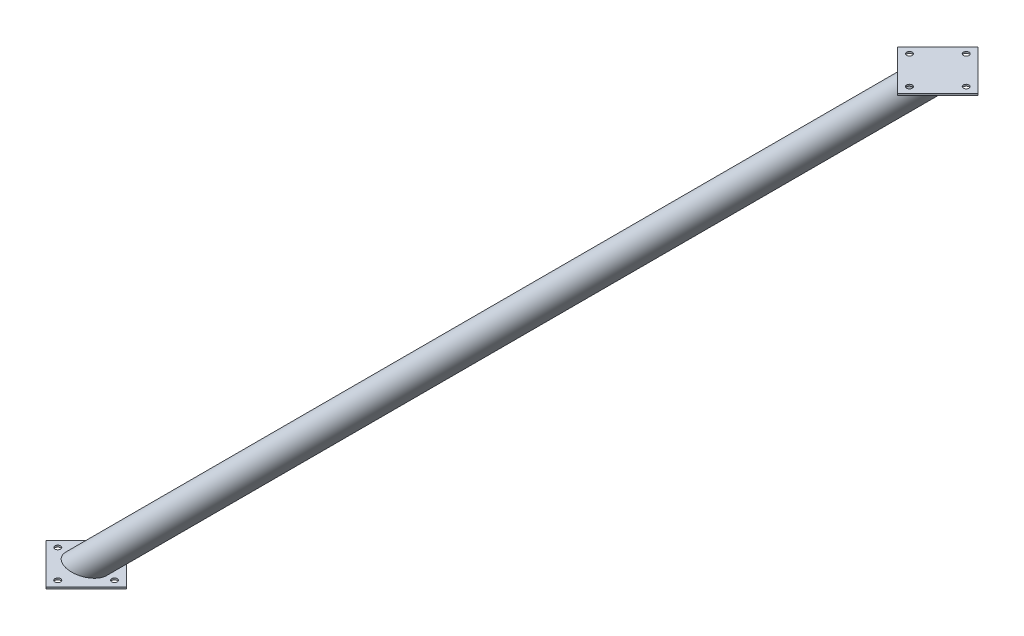
ISO-10303-21;
HEADER;
FILE_DESCRIPTION(('STEP AP214'),'2;1');
FILE_NAME('part.step','',(''),(''),'','','');
FILE_SCHEMA(('AUTOMOTIVE_DESIGN { 1 0 10303 214 1 1 1 1 }'));
ENDSEC;
DATA;
#1=APPLICATION_CONTEXT('core data for automotive mechanical design processes');
#2=APPLICATION_PROTOCOL_DEFINITION('international standard','automotive_design',2000,#1);
#3=PRODUCT_CONTEXT('',#1,'mechanical');
#4=PRODUCT('Part','Part','',(#3));
#5=PRODUCT_RELATED_PRODUCT_CATEGORY('part','',(#4));
#6=PRODUCT_DEFINITION_FORMATION('','',#4);
#7=PRODUCT_DEFINITION_CONTEXT('part definition',#1,'design');
#8=PRODUCT_DEFINITION('design','',#6,#7);
#9=PRODUCT_DEFINITION_SHAPE('','',#8);
#10=(LENGTH_UNIT() NAMED_UNIT(*) SI_UNIT(.MILLI.,.METRE.));
#11=(NAMED_UNIT(*) PLANE_ANGLE_UNIT() SI_UNIT($,.RADIAN.));
#12=(NAMED_UNIT(*) SI_UNIT($,.STERADIAN.) SOLID_ANGLE_UNIT());
#13=UNCERTAINTY_MEASURE_WITH_UNIT(LENGTH_MEASURE(1.E-05),#10,'distance_accuracy_value','');
#14=(GEOMETRIC_REPRESENTATION_CONTEXT(3) GLOBAL_UNCERTAINTY_ASSIGNED_CONTEXT((#13)) GLOBAL_UNIT_ASSIGNED_CONTEXT((#10,
#11,#12)) REPRESENTATION_CONTEXT('',''));
#15=CARTESIAN_POINT('',(0.,0.,0.));
#16=DIRECTION('',(0.,0.,1.));
#17=DIRECTION('',(1.,0.,0.));
#18=AXIS2_PLACEMENT_3D('',#15,#16,#17);
#19=CARTESIAN_POINT('',(1500.,1500.,0.));
#20=DIRECTION('',(0.707106781186548,0.707106781186548,0.));
#21=DIRECTION('',(-0.707106781186548,0.707106781186548,0.));
#22=AXIS2_PLACEMENT_3D('',#19,#20,#21);
#23=CYLINDRICAL_SURFACE('',#22,25.399999999994);
#24=CARTESIAN_POINT('',(1500.00000000001,1500.00000000001,0.));
#25=DIRECTION('',(0.,1.,0.));
#26=DIRECTION('',(1.,0.,0.));
#27=AXIS2_PLACEMENT_3D('',#24,#25,#26);
#28=ELLIPSE('',#27,35.9210244842682,25.399999999994);
#29=CARTESIAN_POINT('',(1535.92102448427,1500.00000000001,0.));
#30=VERTEX_POINT('',#29);
#31=EDGE_CURVE('E59',#30,#30,#28,.T.);
#32=ORIENTED_EDGE('',*,*,#31,.F.);
#33=EDGE_LOOP('',(#32));
#34=FACE_BOUND('',#33,.T.);
#35=CARTESIAN_POINT('',(-3.10862446895044E-11,-3.10862446895044E-11,0.));
#36=DIRECTION('',(0.,-1.,0.));
#37=DIRECTION('',(1.,0.,0.));
#38=AXIS2_PLACEMENT_3D('',#35,#36,#37);
#39=ELLIPSE('',#38,35.9210244842682,25.399999999994);
#40=CARTESIAN_POINT('',(35.9210244842371,-3.10863531097216E-11,0.));
#41=VERTEX_POINT('',#40);
#42=EDGE_CURVE('E11',#41,#41,#39,.T.);
#43=ORIENTED_EDGE('',*,*,#42,.F.);
#44=EDGE_LOOP('',(#43));
#45=FACE_BOUND('',#44,.T.);
#46=ADVANCED_FACE('F48',(#34,#45),#23,.T.);
#47=CARTESIAN_POINT('',(0.,0.,0.));
#48=DIRECTION('',(0.,1.,0.));
#49=DIRECTION('',(-1.,0.,0.));
#50=AXIS2_PLACEMENT_3D('',#47,#48,#49);
#51=PLANE('',#50);
#52=CARTESIAN_POINT('',(-5.23722200826471E-13,0.,-50.));
#53=DIRECTION('',(0.,-1.,0.));
#54=DIRECTION('',(1.,0.,0.));
#55=AXIS2_PLACEMENT_3D('',#52,#53,#54);
#56=CIRCLE('',#55,5.);
#57=CARTESIAN_POINT('',(4.99999999999947,-3.24526984570526E-13,-50.));
#58=VERTEX_POINT('',#57);
#59=EDGE_CURVE('E138',#58,#58,#56,.T.);
#60=ORIENTED_EDGE('',*,*,#59,.T.);
#61=EDGE_LOOP('',(#60));
#62=FACE_BOUND('',#61,.T.);
#63=CARTESIAN_POINT('',(1.74574066942157E-13,0.,50.));
#64=DIRECTION('',(0.,-1.,0.));
#65=DIRECTION('',(1.,0.,0.));
#66=AXIS2_PLACEMENT_3D('',#63,#64,#65);
#67=CIRCLE('',#66,5.);
#68=CARTESIAN_POINT('',(5.00000000000017,-3.24526984570571E-13,50.));
#69=VERTEX_POINT('',#68);
#70=EDGE_CURVE('E212',#69,#69,#67,.T.);
#71=ORIENTED_EDGE('',*,*,#70,.T.);
#72=EDGE_LOOP('',(#71));
#73=FACE_BOUND('',#72,.T.);
#74=DIRECTION('',(-0.707106781186551,0.,0.707106781186544));
#75=VECTOR('',#74,1.);
#76=CARTESIAN_POINT('',(-6.48044415375831E-13,0.,70.7106781186544));
#77=LINE('',#76,#75);
#78=CARTESIAN_POINT('',(70.7106781186543,-4.58950462935727E-12,1.66533453693773E-13));
#79=VERTEX_POINT('',#78);
#80=CARTESIAN_POINT('',(-6.48044415375831E-13,0.,70.7106781186544));
#81=VERTEX_POINT('',#80);
#82=EDGE_CURVE('E228',#79,#81,#77,.T.);
#83=ORIENTED_EDGE('',*,*,#82,.F.);
#84=DIRECTION('',(0.707106781186544,0.,0.707106781186551));
#85=VECTOR('',#84,1.);
#86=CARTESIAN_POINT('',(70.7106781186543,-4.58950462935727E-12,1.66533453693773E-13));
#87=LINE('',#86,#85);
#88=CARTESIAN_POINT('',(-3.88578058618804E-13,0.,-70.7106781186551));
#89=VERTEX_POINT('',#88);
#90=EDGE_CURVE('E91',#89,#79,#87,.T.);
#91=ORIENTED_EDGE('',*,*,#90,.F.);
#92=DIRECTION('',(0.707106781186548,0.,-0.707106781186547));
#93=VECTOR('',#92,1.);
#94=CARTESIAN_POINT('',(-3.88578058618804E-13,0.,-70.7106781186551));
#95=LINE('',#94,#93);
#96=CARTESIAN_POINT('',(-70.7106781186552,4.58950462935733E-12,-4.71844785465692E-13));
#97=VERTEX_POINT('',#96);
#98=EDGE_CURVE('E85',#97,#89,#95,.T.);
#99=ORIENTED_EDGE('',*,*,#98,.F.);
#100=DIRECTION('',(-0.707106781186546,0.,-0.707106781186549));
#101=VECTOR('',#100,1.);
#102=CARTESIAN_POINT('',(-70.7106781186552,4.58950462935733E-12,-4.71844785465692E-13));
#103=LINE('',#102,#101);
#104=EDGE_CURVE('E246',#81,#97,#103,.T.);
#105=ORIENTED_EDGE('',*,*,#104,.F.);
#106=EDGE_LOOP('',(#83,#91,#99,#105));
#107=FACE_BOUND('',#106,.T.);
#108=CARTESIAN_POINT('',(-50.,3.2452698457056E-12,0.));
#109=DIRECTION('',(0.,-1.,0.));
#110=DIRECTION('',(1.,0.,0.));
#111=AXIS2_PLACEMENT_3D('',#108,#109,#110);
#112=CIRCLE('',#111,5.);
#113=CARTESIAN_POINT('',(-45.0000000000001,2.92074286113504E-12,0.));
#114=VERTEX_POINT('',#113);
#115=EDGE_CURVE('E220',#114,#114,#112,.T.);
#116=ORIENTED_EDGE('',*,*,#115,.T.);
#117=EDGE_LOOP('',(#116));
#118=FACE_BOUND('',#117,.T.);
#119=CARTESIAN_POINT('',(50.,-3.2452698457056E-12,-3.49148133884314E-13));
#120=DIRECTION('',(0.,-1.,0.));
#121=DIRECTION('',(1.,0.,0.));
#122=AXIS2_PLACEMENT_3D('',#119,#120,#121);
#123=CIRCLE('',#122,4.99999999999999);
#124=CARTESIAN_POINT('',(55.,-3.56979683027616E-12,-3.49148133884314E-13));
#125=VERTEX_POINT('',#124);
#126=EDGE_CURVE('E204',#125,#125,#123,.T.);
#127=ORIENTED_EDGE('',*,*,#126,.T.);
#128=EDGE_LOOP('',(#127));
#129=FACE_BOUND('',#128,.T.);
#130=ORIENTED_EDGE('',*,*,#42,.T.);
#131=EDGE_LOOP('',(#130));
#132=FACE_BOUND('',#131,.T.);
#133=ADVANCED_FACE('F279',(#62,#73,#107,#118,#129,#132),#51,.T.);
#134=CARTESIAN_POINT('',(-1.94716190742336E-13,-3.,0.));
#135=DIRECTION('',(0.,1.,0.));
#136=DIRECTION('',(-1.,0.,0.));
#137=AXIS2_PLACEMENT_3D('',#134,#135,#136);
#138=PLANE('',#137);
#139=DIRECTION('',(-0.707106781186551,0.,0.707106781186544));
#140=VECTOR('',#139,1.);
#141=CARTESIAN_POINT('',(-8.42760606118167E-13,-3.,70.7106781186544));
#142=LINE('',#141,#140);
#143=CARTESIAN_POINT('',(70.7106781186541,-3.00000000000459,1.66533453693773E-13));
#144=VERTEX_POINT('',#143);
#145=CARTESIAN_POINT('',(-8.42760606118167E-13,-3.,70.7106781186544));
#146=VERTEX_POINT('',#145);
#147=EDGE_CURVE('E232',#144,#146,#142,.T.);
#148=ORIENTED_EDGE('',*,*,#147,.T.);
#149=DIRECTION('',(-0.707106781186546,0.,-0.707106781186549));
#150=VECTOR('',#149,1.);
#151=CARTESIAN_POINT('',(-70.7106781186554,-2.99999999999541,-4.71844785465692E-13));
#152=LINE('',#151,#150);
#153=CARTESIAN_POINT('',(-70.7106781186554,-2.99999999999541,-4.71844785465692E-13));
#154=VERTEX_POINT('',#153);
#155=EDGE_CURVE('E99',#146,#154,#152,.T.);
#156=ORIENTED_EDGE('',*,*,#155,.T.);
#157=DIRECTION('',(0.707106781186548,0.,-0.707106781186547));
#158=VECTOR('',#157,1.);
#159=CARTESIAN_POINT('',(-5.8329424936114E-13,-3.,-70.7106781186551));
#160=LINE('',#159,#158);
#161=CARTESIAN_POINT('',(-5.8329424936114E-13,-3.,-70.7106781186551));
#162=VERTEX_POINT('',#161);
#163=EDGE_CURVE('E237',#154,#162,#160,.T.);
#164=ORIENTED_EDGE('',*,*,#163,.T.);
#165=DIRECTION('',(0.707106781186544,0.,0.707106781186551));
#166=VECTOR('',#165,1.);
#167=CARTESIAN_POINT('',(70.7106781186541,-3.00000000000459,1.66533453693773E-13));
#168=LINE('',#167,#166);
#169=EDGE_CURVE('E67',#162,#144,#168,.T.);
#170=ORIENTED_EDGE('',*,*,#169,.T.);
#171=EDGE_LOOP('',(#148,#156,#164,#170));
#172=FACE_BOUND('',#171,.T.);
#173=CARTESIAN_POINT('',(-50.0000000000002,-2.99999999999676,0.));
#174=DIRECTION('',(0.,-1.,0.));
#175=DIRECTION('',(1.,0.,0.));
#176=AXIS2_PLACEMENT_3D('',#173,#174,#175);
#177=CIRCLE('',#176,5.);
#178=CARTESIAN_POINT('',(-45.0000000000002,-2.99999999999708,0.));
#179=VERTEX_POINT('',#178);
#180=EDGE_CURVE('E224',#179,#179,#177,.T.);
#181=ORIENTED_EDGE('',*,*,#180,.F.);
#182=EDGE_LOOP('',(#181));
#183=FACE_BOUND('',#182,.T.);
#184=CARTESIAN_POINT('',(0.,-3.,50.));
#185=DIRECTION('',(0.,-1.,0.));
#186=DIRECTION('',(1.,0.,0.));
#187=AXIS2_PLACEMENT_3D('',#184,#185,#186);
#188=CIRCLE('',#187,5.);
#189=CARTESIAN_POINT('',(4.99999999999998,-3.00000000000032,50.));
#190=VERTEX_POINT('',#189);
#191=EDGE_CURVE('E216',#190,#190,#188,.T.);
#192=ORIENTED_EDGE('',*,*,#191,.F.);
#193=EDGE_LOOP('',(#192));
#194=FACE_BOUND('',#193,.T.);
#195=CARTESIAN_POINT('',(49.9999999999999,-3.00000000000325,-3.49148133884314E-13));
#196=DIRECTION('',(0.,-1.,0.));
#197=DIRECTION('',(1.,0.,0.));
#198=AXIS2_PLACEMENT_3D('',#195,#196,#197);
#199=CIRCLE('',#198,4.99999999999999);
#200=CARTESIAN_POINT('',(54.9999999999999,-3.00000000000357,-3.49148133884314E-13));
#201=VERTEX_POINT('',#200);
#202=EDGE_CURVE('E208',#201,#201,#199,.T.);
#203=ORIENTED_EDGE('',*,*,#202,.F.);
#204=EDGE_LOOP('',(#203));
#205=FACE_BOUND('',#204,.T.);
#206=CARTESIAN_POINT('',(-7.18438391568806E-13,-3.,-50.));
#207=DIRECTION('',(0.,-1.,0.));
#208=DIRECTION('',(1.,0.,0.));
#209=AXIS2_PLACEMENT_3D('',#206,#207,#208);
#210=CIRCLE('',#209,5.);
#211=CARTESIAN_POINT('',(4.99999999999928,-3.00000000000032,-50.));
#212=VERTEX_POINT('',#211);
#213=EDGE_CURVE('E200',#212,#212,#210,.T.);
#214=ORIENTED_EDGE('',*,*,#213,.F.);
#215=EDGE_LOOP('',(#214));
#216=FACE_BOUND('',#215,.T.);
#217=ADVANCED_FACE('F283',(#172,#183,#194,#205,#216),#138,.F.);
#218=CARTESIAN_POINT('',(-8.42760606118167E-13,-3.,70.7106781186544));
#219=DIRECTION('',(-0.707106781186544,0.,-0.707106781186551));
#220=DIRECTION('',(-0.707106781186551,0.,0.707106781186544));
#221=AXIS2_PLACEMENT_3D('',#218,#219,#220);
#222=PLANE('',#221);
#223=ORIENTED_EDGE('',*,*,#82,.T.);
#224=DIRECTION('',(0.,1.,0.));
#225=VECTOR('',#224,1.);
#226=CARTESIAN_POINT('',(-8.42760606118167E-13,-3.,70.7106781186544));
#227=LINE('',#226,#225);
#228=EDGE_CURVE('E261',#146,#81,#227,.T.);
#229=ORIENTED_EDGE('',*,*,#228,.F.);
#230=ORIENTED_EDGE('',*,*,#147,.F.);
#231=DIRECTION('',(0.,1.,0.));
#232=VECTOR('',#231,1.);
#233=CARTESIAN_POINT('',(70.7106781186541,-3.00000000000459,1.66533453693773E-13));
#234=LINE('',#233,#232);
#235=EDGE_CURVE('E242',#144,#79,#234,.T.);
#236=ORIENTED_EDGE('',*,*,#235,.T.);
#237=EDGE_LOOP('',(#223,#229,#230,#236));
#238=FACE_BOUND('',#237,.T.);
#239=ADVANCED_FACE('F291',(#238),#222,.F.);
#240=CARTESIAN_POINT('',(-70.7106781186554,-2.99999999999541,-4.71844785465692E-13));
#241=DIRECTION('',(0.707106781186549,0.,-0.707106781186546));
#242=DIRECTION('',(-0.707106781186546,0.,-0.707106781186549));
#243=AXIS2_PLACEMENT_3D('',#240,#241,#242);
#244=PLANE('',#243);
#245=ORIENTED_EDGE('',*,*,#104,.T.);
#246=DIRECTION('',(0.,1.,0.));
#247=VECTOR('',#246,1.);
#248=CARTESIAN_POINT('',(-70.7106781186554,-2.99999999999541,-4.71844785465692E-13));
#249=LINE('',#248,#247);
#250=EDGE_CURVE('E258',#154,#97,#249,.T.);
#251=ORIENTED_EDGE('',*,*,#250,.F.);
#252=ORIENTED_EDGE('',*,*,#155,.F.);
#253=ORIENTED_EDGE('',*,*,#228,.T.);
#254=EDGE_LOOP('',(#245,#251,#252,#253));
#255=FACE_BOUND('',#254,.T.);
#256=ADVANCED_FACE('F389',(#255),#244,.F.);
#257=CARTESIAN_POINT('',(-5.8329424936114E-13,-3.,-70.7106781186551));
#258=DIRECTION('',(0.707106781186547,0.,0.707106781186548));
#259=DIRECTION('',(0.707106781186548,0.,-0.707106781186547));
#260=AXIS2_PLACEMENT_3D('',#257,#258,#259);
#261=PLANE('',#260);
#262=ORIENTED_EDGE('',*,*,#98,.T.);
#263=DIRECTION('',(0.,1.,0.));
#264=VECTOR('',#263,1.);
#265=CARTESIAN_POINT('',(-5.8329424936114E-13,-3.,-70.7106781186551));
#266=LINE('',#265,#264);
#267=EDGE_CURVE('E255',#162,#89,#266,.T.);
#268=ORIENTED_EDGE('',*,*,#267,.F.);
#269=ORIENTED_EDGE('',*,*,#163,.F.);
#270=ORIENTED_EDGE('',*,*,#250,.T.);
#271=EDGE_LOOP('',(#262,#268,#269,#270));
#272=FACE_BOUND('',#271,.T.);
#273=ADVANCED_FACE('F364',(#272),#261,.F.);
#274=CARTESIAN_POINT('',(70.7106781186541,-3.00000000000459,1.66533453693773E-13));
#275=DIRECTION('',(-0.707106781186551,0.,0.707106781186544));
#276=DIRECTION('',(0.707106781186544,0.,0.707106781186551));
#277=AXIS2_PLACEMENT_3D('',#274,#275,#276);
#278=PLANE('',#277);
#279=ORIENTED_EDGE('',*,*,#90,.T.);
#280=ORIENTED_EDGE('',*,*,#235,.F.);
#281=ORIENTED_EDGE('',*,*,#169,.F.);
#282=ORIENTED_EDGE('',*,*,#267,.T.);
#283=EDGE_LOOP('',(#279,#280,#281,#282));
#284=FACE_BOUND('',#283,.T.);
#285=ADVANCED_FACE('F359',(#284),#278,.F.);
#286=CARTESIAN_POINT('',(-50.0000000000002,-2.99999999999676,0.));
#287=DIRECTION('',(0.,1.,0.));
#288=DIRECTION('',(-1.,0.,0.));
#289=AXIS2_PLACEMENT_3D('',#286,#287,#288);
#290=CYLINDRICAL_SURFACE('',#289,5.);
#291=ORIENTED_EDGE('',*,*,#180,.T.);
#292=EDGE_LOOP('',(#291));
#293=FACE_BOUND('',#292,.T.);
#294=ORIENTED_EDGE('',*,*,#115,.F.);
#295=EDGE_LOOP('',(#294));
#296=FACE_BOUND('',#295,.T.);
#297=ADVANCED_FACE('F356',(#293,#296),#290,.F.);
#298=CARTESIAN_POINT('',(0.,-3.,50.));
#299=DIRECTION('',(0.,1.,0.));
#300=DIRECTION('',(-1.,0.,0.));
#301=AXIS2_PLACEMENT_3D('',#298,#299,#300);
#302=CYLINDRICAL_SURFACE('',#301,5.);
#303=ORIENTED_EDGE('',*,*,#191,.T.);
#304=EDGE_LOOP('',(#303));
#305=FACE_BOUND('',#304,.T.);
#306=ORIENTED_EDGE('',*,*,#70,.F.);
#307=EDGE_LOOP('',(#306));
#308=FACE_BOUND('',#307,.T.);
#309=ADVANCED_FACE('F352',(#305,#308),#302,.F.);
#310=CARTESIAN_POINT('',(49.9999999999999,-3.00000000000325,-3.49148133884314E-13));
#311=DIRECTION('',(0.,1.,0.));
#312=DIRECTION('',(-1.,0.,0.));
#313=AXIS2_PLACEMENT_3D('',#310,#311,#312);
#314=CYLINDRICAL_SURFACE('',#313,4.99999999999999);
#315=ORIENTED_EDGE('',*,*,#202,.T.);
#316=EDGE_LOOP('',(#315));
#317=FACE_BOUND('',#316,.T.);
#318=ORIENTED_EDGE('',*,*,#126,.F.);
#319=EDGE_LOOP('',(#318));
#320=FACE_BOUND('',#319,.T.);
#321=ADVANCED_FACE('F320',(#317,#320),#314,.F.);
#322=CARTESIAN_POINT('',(-7.18438391568806E-13,-3.,-50.));
#323=DIRECTION('',(0.,1.,0.));
#324=DIRECTION('',(-1.,0.,0.));
#325=AXIS2_PLACEMENT_3D('',#322,#323,#324);
#326=CYLINDRICAL_SURFACE('',#325,5.);
#327=ORIENTED_EDGE('',*,*,#213,.T.);
#328=EDGE_LOOP('',(#327));
#329=FACE_BOUND('',#328,.T.);
#330=ORIENTED_EDGE('',*,*,#59,.F.);
#331=EDGE_LOOP('',(#330));
#332=FACE_BOUND('',#331,.T.);
#333=ADVANCED_FACE('F313',(#329,#332),#326,.F.);
#334=CARTESIAN_POINT('',(0.,1500.00000000001,0.));
#335=DIRECTION('',(0.,1.,0.));
#336=DIRECTION('',(0.,0.,1.));
#337=AXIS2_PLACEMENT_3D('',#334,#335,#336);
#338=PLANE('',#337);
#339=DIRECTION('',(0.707106781186548,0.,0.707106781186547));
#340=VECTOR('',#339,1.);
#341=CARTESIAN_POINT('',(785.355339059329,1500.00000000001,-785.35533905933));
#342=LINE('',#341,#340);
#343=CARTESIAN_POINT('',(1500.,1500.00000000001,-70.7106781186543));
#344=VERTEX_POINT('',#343);
#345=CARTESIAN_POINT('',(1570.71067811866,1500.00000000001,3.33066907387547E-13));
#346=VERTEX_POINT('',#345);
#347=EDGE_CURVE('E132',#344,#346,#342,.T.);
#348=ORIENTED_EDGE('',*,*,#347,.T.);
#349=DIRECTION('',(-0.707106781186548,0.,0.707106781186547));
#350=VECTOR('',#349,1.);
#351=CARTESIAN_POINT('',(785.355339059328,1500.00000000001,785.35533905933));
#352=LINE('',#351,#350);
#353=CARTESIAN_POINT('',(1500.,1500.00000000001,70.7106781186546));
#354=VERTEX_POINT('',#353);
#355=EDGE_CURVE('E188',#346,#354,#352,.T.);
#356=ORIENTED_EDGE('',*,*,#355,.T.);
#357=DIRECTION('',(-0.707106781186547,0.,-0.707106781186548));
#358=VECTOR('',#357,1.);
#359=CARTESIAN_POINT('',(714.644660940677,1500.00000000001,-714.644660940675));
#360=LINE('',#359,#358);
#361=CARTESIAN_POINT('',(1429.28932188135,1500.00000000001,2.22044604925031E-13));
#362=VERTEX_POINT('',#361);
#363=EDGE_CURVE('E184',#354,#362,#360,.T.);
#364=ORIENTED_EDGE('',*,*,#363,.T.);
#365=DIRECTION('',(0.707106781186547,0.,-0.707106781186548));
#366=VECTOR('',#365,1.);
#367=CARTESIAN_POINT('',(714.644660940676,1500.00000000001,714.644660940675));
#368=LINE('',#367,#366);
#369=EDGE_CURVE('E181',#362,#344,#368,.T.);
#370=ORIENTED_EDGE('',*,*,#369,.T.);
#371=EDGE_LOOP('',(#348,#356,#364,#370));
#372=FACE_BOUND('',#371,.T.);
#373=CARTESIAN_POINT('',(1500.,1500.00000000001,-49.9999999999999));
#374=DIRECTION('',(0.,1.,0.));
#375=DIRECTION('',(0.,0.,1.));
#376=AXIS2_PLACEMENT_3D('',#373,#374,#375);
#377=CIRCLE('',#376,5.00000000000005);
#378=CARTESIAN_POINT('',(1500.,1500.00000000001,-44.9999999999999));
#379=VERTEX_POINT('',#378);
#380=EDGE_CURVE('E175',#379,#379,#377,.T.);
#381=ORIENTED_EDGE('',*,*,#380,.T.);
#382=EDGE_LOOP('',(#381));
#383=FACE_BOUND('',#382,.T.);
#384=CARTESIAN_POINT('',(1550.,1500.00000000001,-2.22044604925031E-13));
#385=DIRECTION('',(0.,1.,0.));
#386=DIRECTION('',(0.,0.,1.));
#387=AXIS2_PLACEMENT_3D('',#384,#385,#386);
#388=CIRCLE('',#387,5.00000000000005);
#389=CARTESIAN_POINT('',(1550.,1500.00000000001,4.99999999999983));
#390=VERTEX_POINT('',#389);
#391=EDGE_CURVE('E171',#390,#390,#388,.T.);
#392=ORIENTED_EDGE('',*,*,#391,.T.);
#393=EDGE_LOOP('',(#392));
#394=FACE_BOUND('',#393,.T.);
#395=CARTESIAN_POINT('',(1500.,1500.00000000001,49.9999999999996));
#396=DIRECTION('',(0.,1.,0.));
#397=DIRECTION('',(0.,0.,1.));
#398=AXIS2_PLACEMENT_3D('',#395,#396,#397);
#399=CIRCLE('',#398,5.00000000000005);
#400=CARTESIAN_POINT('',(1500.,1500.00000000001,54.9999999999997));
#401=VERTEX_POINT('',#400);
#402=EDGE_CURVE('E167',#401,#401,#399,.T.);
#403=ORIENTED_EDGE('',*,*,#402,.T.);
#404=EDGE_LOOP('',(#403));
#405=FACE_BOUND('',#404,.T.);
#406=CARTESIAN_POINT('',(1450.00000000001,1500.00000000001,0.));
#407=DIRECTION('',(0.,1.,0.));
#408=DIRECTION('',(0.,0.,1.));
#409=AXIS2_PLACEMENT_3D('',#406,#407,#408);
#410=CIRCLE('',#409,4.99999999999982);
#411=CARTESIAN_POINT('',(1450.00000000001,1500.00000000001,4.99999999999982));
#412=VERTEX_POINT('',#411);
#413=EDGE_CURVE('E163',#412,#412,#410,.T.);
#414=ORIENTED_EDGE('',*,*,#413,.T.);
#415=EDGE_LOOP('',(#414));
#416=FACE_BOUND('',#415,.T.);
#417=ORIENTED_EDGE('',*,*,#31,.T.);
#418=EDGE_LOOP('',(#417));
#419=FACE_BOUND('',#418,.T.);
#420=ADVANCED_FACE('F275',(#372,#383,#394,#405,#416,#419),#338,.F.);
#421=CARTESIAN_POINT('',(785.355339059329,1503.00000000001,-785.35533905933));
#422=DIRECTION('',(0.707106781186547,0.,-0.707106781186548));
#423=DIRECTION('',(-0.707106781186548,0.,-0.707106781186547));
#424=AXIS2_PLACEMENT_3D('',#421,#422,#423);
#425=PLANE('',#424);
#426=ORIENTED_EDGE('',*,*,#347,.F.);
#427=DIRECTION('',(0.,-1.,0.));
#428=VECTOR('',#427,1.);
#429=CARTESIAN_POINT('',(1500.,1503.00000000001,-70.7106781186543));
#430=LINE('',#429,#428);
#431=CARTESIAN_POINT('',(1500.,1503.00000000001,-70.7106781186543));
#432=VERTEX_POINT('',#431);
#433=EDGE_CURVE('E126',#432,#344,#430,.T.);
#434=ORIENTED_EDGE('',*,*,#433,.F.);
#435=DIRECTION('',(0.707106781186548,0.,0.707106781186547));
#436=VECTOR('',#435,1.);
#437=CARTESIAN_POINT('',(785.355339059329,1503.00000000001,-785.35533905933));
#438=LINE('',#437,#436);
#439=CARTESIAN_POINT('',(1570.71067811866,1503.00000000001,3.33066907387547E-13));
#440=VERTEX_POINT('',#439);
#441=EDGE_CURVE('E129',#432,#440,#438,.T.);
#442=ORIENTED_EDGE('',*,*,#441,.T.);
#443=DIRECTION('',(0.,-1.,0.));
#444=VECTOR('',#443,1.);
#445=CARTESIAN_POINT('',(1570.71067811866,1503.00000000001,3.33066907387547E-13));
#446=LINE('',#445,#444);
#447=EDGE_CURVE('E162',#440,#346,#446,.T.);
#448=ORIENTED_EDGE('',*,*,#447,.T.);
#449=EDGE_LOOP('',(#426,#434,#442,#448));
#450=FACE_BOUND('',#449,.T.);
#451=ADVANCED_FACE('F128',(#450),#425,.T.);
#452=CARTESIAN_POINT('',(714.644660940676,1503.00000000001,714.644660940675));
#453=DIRECTION('',(-0.707106781186548,0.,-0.707106781186547));
#454=DIRECTION('',(-0.707106781186547,0.,0.707106781186548));
#455=AXIS2_PLACEMENT_3D('',#452,#453,#454);
#456=PLANE('',#455);
#457=ORIENTED_EDGE('',*,*,#369,.F.);
#458=DIRECTION('',(0.,-1.,0.));
#459=VECTOR('',#458,1.);
#460=CARTESIAN_POINT('',(1429.28932188135,1503.00000000001,2.22044604925031E-13));
#461=LINE('',#460,#459);
#462=CARTESIAN_POINT('',(1429.28932188135,1503.00000000001,2.22044604925031E-13));
#463=VERTEX_POINT('',#462);
#464=EDGE_CURVE('E139',#463,#362,#461,.T.);
#465=ORIENTED_EDGE('',*,*,#464,.F.);
#466=DIRECTION('',(0.707106781186547,0.,-0.707106781186548));
#467=VECTOR('',#466,1.);
#468=CARTESIAN_POINT('',(714.644660940676,1503.00000000001,714.644660940675));
#469=LINE('',#468,#467);
#470=EDGE_CURVE('E145',#463,#432,#469,.T.);
#471=ORIENTED_EDGE('',*,*,#470,.T.);
#472=ORIENTED_EDGE('',*,*,#433,.T.);
#473=EDGE_LOOP('',(#457,#465,#471,#472));
#474=FACE_BOUND('',#473,.T.);
#475=ADVANCED_FACE('F152',(#474),#456,.T.);
#476=CARTESIAN_POINT('',(714.644660940677,1503.00000000001,-714.644660940675));
#477=DIRECTION('',(-0.707106781186548,0.,0.707106781186547));
#478=DIRECTION('',(0.707106781186547,0.,0.707106781186548));
#479=AXIS2_PLACEMENT_3D('',#476,#477,#478);
#480=PLANE('',#479);
#481=ORIENTED_EDGE('',*,*,#363,.F.);
#482=DIRECTION('',(0.,-1.,0.));
#483=VECTOR('',#482,1.);
#484=CARTESIAN_POINT('',(1500.,1503.00000000001,70.7106781186546));
#485=LINE('',#484,#483);
#486=CARTESIAN_POINT('',(1500.,1503.00000000001,70.7106781186546));
#487=VERTEX_POINT('',#486);
#488=EDGE_CURVE('E195',#487,#354,#485,.T.);
#489=ORIENTED_EDGE('',*,*,#488,.F.);
#490=DIRECTION('',(-0.707106781186547,0.,-0.707106781186548));
#491=VECTOR('',#490,1.);
#492=CARTESIAN_POINT('',(714.644660940677,1503.00000000001,-714.644660940675));
#493=LINE('',#492,#491);
#494=EDGE_CURVE('E154',#487,#463,#493,.T.);
#495=ORIENTED_EDGE('',*,*,#494,.T.);
#496=ORIENTED_EDGE('',*,*,#464,.T.);
#497=EDGE_LOOP('',(#481,#489,#495,#496));
#498=FACE_BOUND('',#497,.T.);
#499=ADVANCED_FACE('F477',(#498),#480,.T.);
#500=CARTESIAN_POINT('',(1500.,1503.00000000001,-49.9999999999999));
#501=DIRECTION('',(0.,-1.,0.));
#502=DIRECTION('',(0.,0.,-1.));
#503=AXIS2_PLACEMENT_3D('',#500,#501,#502);
#504=CYLINDRICAL_SURFACE('',#503,5.00000000000005);
#505=CARTESIAN_POINT('',(1500.,1503.00000000001,-49.9999999999999));
#506=DIRECTION('',(0.,1.,0.));
#507=DIRECTION('',(0.,0.,1.));
#508=AXIS2_PLACEMENT_3D('',#505,#506,#507);
#509=CIRCLE('',#508,5.00000000000005);
#510=CARTESIAN_POINT('',(1500.,1503.00000000001,-44.9999999999999));
#511=VERTEX_POINT('',#510);
#512=EDGE_CURVE('E150',#511,#511,#509,.T.);
#513=ORIENTED_EDGE('',*,*,#512,.T.);
#514=EDGE_LOOP('',(#513));
#515=FACE_BOUND('',#514,.T.);
#516=ORIENTED_EDGE('',*,*,#380,.F.);
#517=EDGE_LOOP('',(#516));
#518=FACE_BOUND('',#517,.T.);
#519=ADVANCED_FACE('F485',(#515,#518),#504,.F.);
#520=CARTESIAN_POINT('',(1550.,1503.00000000001,-2.22044604925031E-13));
#521=DIRECTION('',(0.,-1.,0.));
#522=DIRECTION('',(0.,0.,-1.));
#523=AXIS2_PLACEMENT_3D('',#520,#521,#522);
#524=CYLINDRICAL_SURFACE('',#523,5.00000000000005);
#525=CARTESIAN_POINT('',(1550.,1503.00000000001,-2.22044604925031E-13));
#526=DIRECTION('',(0.,1.,0.));
#527=DIRECTION('',(0.,0.,1.));
#528=AXIS2_PLACEMENT_3D('',#525,#526,#527);
#529=CIRCLE('',#528,5.00000000000005);
#530=CARTESIAN_POINT('',(1550.,1503.00000000001,4.99999999999983));
#531=VERTEX_POINT('',#530);
#532=EDGE_CURVE('E539',#531,#531,#529,.T.);
#533=ORIENTED_EDGE('',*,*,#532,.T.);
#534=EDGE_LOOP('',(#533));
#535=FACE_BOUND('',#534,.T.);
#536=ORIENTED_EDGE('',*,*,#391,.F.);
#537=EDGE_LOOP('',(#536));
#538=FACE_BOUND('',#537,.T.);
#539=ADVANCED_FACE('F344',(#535,#538),#524,.F.);
#540=CARTESIAN_POINT('',(1500.,1503.00000000001,49.9999999999996));
#541=DIRECTION('',(0.,-1.,0.));
#542=DIRECTION('',(0.,0.,-1.));
#543=AXIS2_PLACEMENT_3D('',#540,#541,#542);
#544=CYLINDRICAL_SURFACE('',#543,5.00000000000005);
#545=CARTESIAN_POINT('',(1500.,1503.00000000001,49.9999999999996));
#546=DIRECTION('',(0.,1.,0.));
#547=DIRECTION('',(0.,0.,1.));
#548=AXIS2_PLACEMENT_3D('',#545,#546,#547);
#549=CIRCLE('',#548,5.00000000000005);
#550=CARTESIAN_POINT('',(1500.,1503.00000000001,54.9999999999997));
#551=VERTEX_POINT('',#550);
#552=EDGE_CURVE('E535',#551,#551,#549,.T.);
#553=ORIENTED_EDGE('',*,*,#552,.T.);
#554=EDGE_LOOP('',(#553));
#555=FACE_BOUND('',#554,.T.);
#556=ORIENTED_EDGE('',*,*,#402,.F.);
#557=EDGE_LOOP('',(#556));
#558=FACE_BOUND('',#557,.T.);
#559=ADVANCED_FACE('F336',(#555,#558),#544,.F.);
#560=CARTESIAN_POINT('',(1450.00000000001,1503.00000000001,0.));
#561=DIRECTION('',(0.,-1.,0.));
#562=DIRECTION('',(0.,0.,-1.));
#563=AXIS2_PLACEMENT_3D('',#560,#561,#562);
#564=CYLINDRICAL_SURFACE('',#563,4.99999999999982);
#565=CARTESIAN_POINT('',(1450.00000000001,1503.00000000001,0.));
#566=DIRECTION('',(0.,1.,0.));
#567=DIRECTION('',(0.,0.,1.));
#568=AXIS2_PLACEMENT_3D('',#565,#566,#567);
#569=CIRCLE('',#568,4.99999999999982);
#570=CARTESIAN_POINT('',(1450.00000000001,1503.00000000001,4.99999999999982));
#571=VERTEX_POINT('',#570);
#572=EDGE_CURVE('E192',#571,#571,#569,.T.);
#573=ORIENTED_EDGE('',*,*,#572,.T.);
#574=EDGE_LOOP('',(#573));
#575=FACE_BOUND('',#574,.T.);
#576=ORIENTED_EDGE('',*,*,#413,.F.);
#577=EDGE_LOOP('',(#576));
#578=FACE_BOUND('',#577,.T.);
#579=ADVANCED_FACE('F333',(#575,#578),#564,.F.);
#580=CARTESIAN_POINT('',(785.355339059328,1503.00000000001,785.35533905933));
#581=DIRECTION('',(0.707106781186547,0.,0.707106781186548));
#582=DIRECTION('',(0.707106781186548,0.,-0.707106781186547));
#583=AXIS2_PLACEMENT_3D('',#580,#581,#582);
#584=PLANE('',#583);
#585=ORIENTED_EDGE('',*,*,#355,.F.);
#586=ORIENTED_EDGE('',*,*,#447,.F.);
#587=DIRECTION('',(-0.707106781186548,0.,0.707106781186547));
#588=VECTOR('',#587,1.);
#589=CARTESIAN_POINT('',(785.355339059328,1503.00000000001,785.35533905933));
#590=LINE('',#589,#588);
#591=EDGE_CURVE('E148',#440,#487,#590,.T.);
#592=ORIENTED_EDGE('',*,*,#591,.T.);
#593=ORIENTED_EDGE('',*,*,#488,.T.);
#594=EDGE_LOOP('',(#585,#586,#592,#593));
#595=FACE_BOUND('',#594,.T.);
#596=ADVANCED_FACE('F335',(#595),#584,.T.);
#597=CARTESIAN_POINT('',(0.,1503.00000000001,0.));
#598=DIRECTION('',(0.,1.,0.));
#599=DIRECTION('',(0.,0.,1.));
#600=AXIS2_PLACEMENT_3D('',#597,#598,#599);
#601=PLANE('',#600);
#602=ORIENTED_EDGE('',*,*,#572,.F.);
#603=EDGE_LOOP('',(#602));
#604=FACE_BOUND('',#603,.T.);
#605=ORIENTED_EDGE('',*,*,#552,.F.);
#606=EDGE_LOOP('',(#605));
#607=FACE_BOUND('',#606,.T.);
#608=ORIENTED_EDGE('',*,*,#532,.F.);
#609=EDGE_LOOP('',(#608));
#610=FACE_BOUND('',#609,.T.);
#611=ORIENTED_EDGE('',*,*,#512,.F.);
#612=EDGE_LOOP('',(#611));
#613=FACE_BOUND('',#612,.T.);
#614=ORIENTED_EDGE('',*,*,#441,.F.);
#615=ORIENTED_EDGE('',*,*,#470,.F.);
#616=ORIENTED_EDGE('',*,*,#494,.F.);
#617=ORIENTED_EDGE('',*,*,#591,.F.);
#618=EDGE_LOOP('',(#614,#615,#616,#617));
#619=FACE_BOUND('',#618,.T.);
#620=ADVANCED_FACE('F143',(#604,#607,#610,#613,#619),#601,.T.);
#621=CLOSED_SHELL('',(#46,#133,#217,#239,#256,#273,#285,#297,#309,#321,#333,#420,#451,#475,#499,
#519,#539,#559,#579,#596,#620));
#622=CARTESIAN_POINT('',(1500.00000000001,1500.00000000001,0.));
#623=DIRECTION('',(0.,1.,0.));
#624=DIRECTION('',(1.,0.,0.));
#625=AXIS2_PLACEMENT_3D('',#622,#623,#624);
#626=ELLIPSE('',#625,33.092597359553,23.400000000016);
#627=CARTESIAN_POINT('',(1533.09259735956,1500.00000000001,0.));
#628=VERTEX_POINT('',#627);
#629=EDGE_CURVE('E264',#628,#628,#626,.F.);
#630=ORIENTED_EDGE('',*,*,#629,.T.);
#631=EDGE_LOOP('',(#630));
#632=FACE_BOUND('',#631,.T.);
#633=ADVANCED_FACE('F295',(#632),#338,.F.);
#634=CARTESIAN_POINT('',(-3.10862446895044E-11,-3.10862446895044E-11,0.));
#635=DIRECTION('',(0.,-1.,0.));
#636=DIRECTION('',(1.,0.,0.));
#637=AXIS2_PLACEMENT_3D('',#634,#635,#636);
#638=ELLIPSE('',#637,33.092597359553,23.400000000016);
#639=CARTESIAN_POINT('',(33.092597359522,-3.10863445726967E-11,0.));
#640=VERTEX_POINT('',#639);
#641=EDGE_CURVE('E268',#640,#640,#638,.F.);
#642=ORIENTED_EDGE('',*,*,#641,.T.);
#643=EDGE_LOOP('',(#642));
#644=FACE_BOUND('',#643,.T.);
#645=ADVANCED_FACE('F286',(#644),#51,.T.);
#646=CARTESIAN_POINT('',(1500.,1500.,0.));
#647=DIRECTION('',(0.707106781186548,0.707106781186548,0.));
#648=DIRECTION('',(-0.707106781186548,0.707106781186548,0.));
#649=AXIS2_PLACEMENT_3D('',#646,#647,#648);
#650=CYLINDRICAL_SURFACE('',#649,23.400000000016);
#651=ORIENTED_EDGE('',*,*,#629,.F.);
#652=EDGE_LOOP('',(#651));
#653=FACE_BOUND('',#652,.T.);
#654=ORIENTED_EDGE('',*,*,#641,.F.);
#655=EDGE_LOOP('',(#654));
#656=FACE_BOUND('',#655,.T.);
#657=ADVANCED_FACE('F50',(#653,#656),#650,.F.);
#658=CLOSED_SHELL('',(#633,#645,#657));
#659=ORIENTED_CLOSED_SHELL('',*,#658,.T.);
#660=BREP_WITH_VOIDS('B2',#621,(#659));
#661=ADVANCED_BREP_SHAPE_REPRESENTATION('',(#18,#660),#14);
#662=SHAPE_DEFINITION_REPRESENTATION(#9,#661);
ENDSEC;
END-ISO-10303-21;
